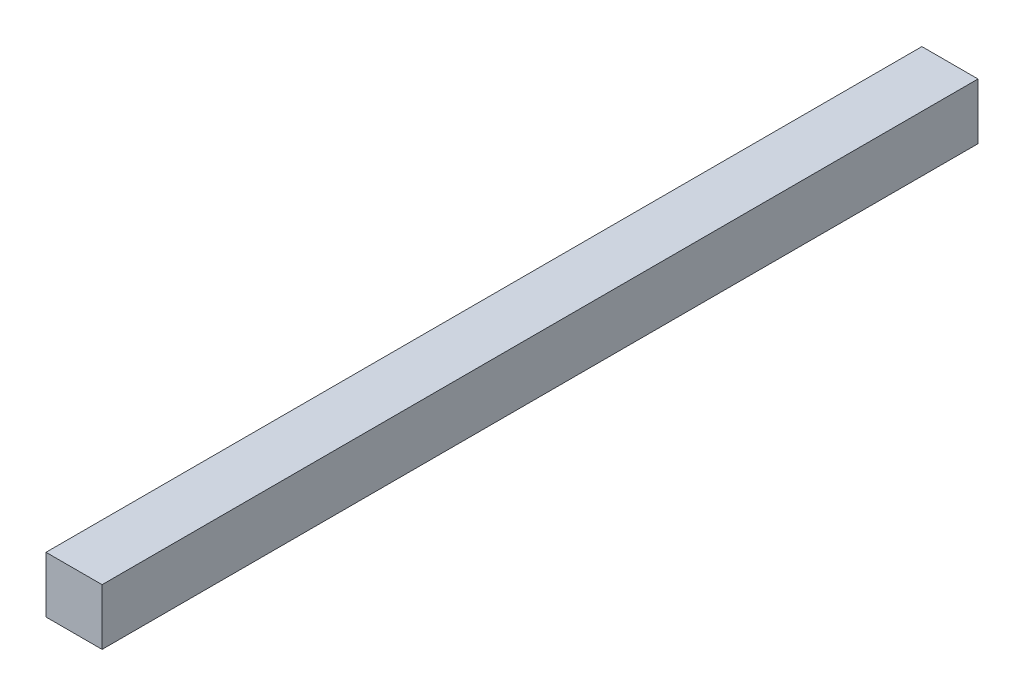
ISO-10303-21;
HEADER;
FILE_DESCRIPTION(('STEP AP214'),'2;1');
FILE_NAME('part.step','',(''),(''),'','','');
FILE_SCHEMA(('AUTOMOTIVE_DESIGN { 1 0 10303 214 1 1 1 1 }'));
ENDSEC;
DATA;
#1=APPLICATION_CONTEXT('core data for automotive mechanical design processes');
#2=APPLICATION_PROTOCOL_DEFINITION('international standard','automotive_design',2000,#1);
#3=PRODUCT_CONTEXT('',#1,'mechanical');
#4=PRODUCT('Part','Part','',(#3));
#5=PRODUCT_RELATED_PRODUCT_CATEGORY('part','',(#4));
#6=PRODUCT_DEFINITION_FORMATION('','',#4);
#7=PRODUCT_DEFINITION_CONTEXT('part definition',#1,'design');
#8=PRODUCT_DEFINITION('design','',#6,#7);
#9=PRODUCT_DEFINITION_SHAPE('','',#8);
#10=(LENGTH_UNIT() NAMED_UNIT(*) SI_UNIT(.MILLI.,.METRE.));
#11=(NAMED_UNIT(*) PLANE_ANGLE_UNIT() SI_UNIT($,.RADIAN.));
#12=(NAMED_UNIT(*) SI_UNIT($,.STERADIAN.) SOLID_ANGLE_UNIT());
#13=UNCERTAINTY_MEASURE_WITH_UNIT(LENGTH_MEASURE(1.E-05),#10,'distance_accuracy_value','');
#14=(GEOMETRIC_REPRESENTATION_CONTEXT(3) GLOBAL_UNCERTAINTY_ASSIGNED_CONTEXT((#13)) GLOBAL_UNIT_ASSIGNED_CONTEXT((#10,
#11,#12)) REPRESENTATION_CONTEXT('',''));
#15=CARTESIAN_POINT('',(0.,0.,0.));
#16=DIRECTION('',(0.,0.,1.));
#17=DIRECTION('',(1.,0.,0.));
#18=AXIS2_PLACEMENT_3D('',#15,#16,#17);
#19=CARTESIAN_POINT('',(-145.065848885291,10.0087439398412,-465.85441718585));
#20=DIRECTION('',(1.,0.,0.));
#21=DIRECTION('',(0.,0.,-1.));
#22=AXIS2_PLACEMENT_3D('',#19,#20,#21);
#23=PLANE('',#22);
#24=DIRECTION('',(0.,1.,0.));
#25=VECTOR('',#24,1.);
#26=CARTESIAN_POINT('',(-145.065848885291,10.0087439398412,4.14558281415001));
#27=LINE('',#26,#25);
#28=CARTESIAN_POINT('',(-145.065848885291,-20.0823309429157,4.14558281415001));
#29=VERTEX_POINT('',#28);
#30=CARTESIAN_POINT('',(-145.065848885291,10.0087439398412,4.14558281415001));
#31=VERTEX_POINT('',#30);
#32=EDGE_CURVE('E97',#29,#31,#27,.T.);
#33=ORIENTED_EDGE('',*,*,#32,.F.);
#34=DIRECTION('',(0.,0.,1.));
#35=VECTOR('',#34,1.);
#36=CARTESIAN_POINT('',(-145.065848885291,-20.0823309429157,-465.85441718585));
#37=LINE('',#36,#35);
#38=CARTESIAN_POINT('',(-145.065848885291,-20.0823309429157,-465.85441718585));
#39=VERTEX_POINT('',#38);
#40=EDGE_CURVE('E11',#39,#29,#37,.T.);
#41=ORIENTED_EDGE('',*,*,#40,.F.);
#42=DIRECTION('',(0.,1.,0.));
#43=VECTOR('',#42,1.);
#44=CARTESIAN_POINT('',(-145.065848885291,10.0087439398412,-465.85441718585));
#45=LINE('',#44,#43);
#46=CARTESIAN_POINT('',(-145.065848885291,10.0087439398412,-465.85441718585));
#47=VERTEX_POINT('',#46);
#48=EDGE_CURVE('E91',#39,#47,#45,.T.);
#49=ORIENTED_EDGE('',*,*,#48,.T.);
#50=DIRECTION('',(0.,0.,1.));
#51=VECTOR('',#50,1.);
#52=CARTESIAN_POINT('',(-145.065848885291,10.0087439398412,-465.85441718585));
#53=LINE('',#52,#51);
#54=EDGE_CURVE('E36',#47,#31,#53,.T.);
#55=ORIENTED_EDGE('',*,*,#54,.T.);
#56=EDGE_LOOP('',(#33,#41,#49,#55));
#57=FACE_BOUND('',#56,.T.);
#58=ADVANCED_FACE('F33',(#57),#23,.T.);
#59=CARTESIAN_POINT('',(-145.065848885291,-20.0823309429157,-465.85441718585));
#60=DIRECTION('',(0.,-1.,0.));
#61=DIRECTION('',(1.,0.,0.));
#62=AXIS2_PLACEMENT_3D('',#59,#60,#61);
#63=PLANE('',#62);
#64=DIRECTION('',(1.,0.,0.));
#65=VECTOR('',#64,1.);
#66=CARTESIAN_POINT('',(-145.065848885291,-20.0823309429157,4.14558281415001));
#67=LINE('',#66,#65);
#68=CARTESIAN_POINT('',(-175.168107780159,-20.0823309429157,4.14558281415001));
#69=VERTEX_POINT('',#68);
#70=EDGE_CURVE('E93',#69,#29,#67,.T.);
#71=ORIENTED_EDGE('',*,*,#70,.F.);
#72=DIRECTION('',(0.,0.,1.));
#73=VECTOR('',#72,1.);
#74=CARTESIAN_POINT('',(-175.168107780159,-20.0823309429157,-465.85441718585));
#75=LINE('',#74,#73);
#76=CARTESIAN_POINT('',(-175.168107780159,-20.0823309429157,-465.85441718585));
#77=VERTEX_POINT('',#76);
#78=EDGE_CURVE('E42',#77,#69,#75,.T.);
#79=ORIENTED_EDGE('',*,*,#78,.F.);
#80=DIRECTION('',(1.,0.,0.));
#81=VECTOR('',#80,1.);
#82=CARTESIAN_POINT('',(-145.065848885291,-20.0823309429157,-465.85441718585));
#83=LINE('',#82,#81);
#84=EDGE_CURVE('E88',#77,#39,#83,.T.);
#85=ORIENTED_EDGE('',*,*,#84,.T.);
#86=ORIENTED_EDGE('',*,*,#40,.T.);
#87=EDGE_LOOP('',(#71,#79,#85,#86));
#88=FACE_BOUND('',#87,.T.);
#89=ADVANCED_FACE('F107',(#88),#63,.T.);
#90=CARTESIAN_POINT('',(-175.168107780159,10.0087439398412,-465.85441718585));
#91=DIRECTION('',(-1.,0.,0.));
#92=DIRECTION('',(0.,0.,1.));
#93=AXIS2_PLACEMENT_3D('',#90,#91,#92);
#94=PLANE('',#93);
#95=DIRECTION('',(0.,-1.,0.));
#96=VECTOR('',#95,1.);
#97=CARTESIAN_POINT('',(-175.168107780159,10.0087439398412,4.14558281415001));
#98=LINE('',#97,#96);
#99=CARTESIAN_POINT('',(-175.168107780159,10.0087439398412,4.14558281415001));
#100=VERTEX_POINT('',#99);
#101=EDGE_CURVE('E83',#100,#69,#98,.T.);
#102=ORIENTED_EDGE('',*,*,#101,.F.);
#103=DIRECTION('',(0.,0.,1.));
#104=VECTOR('',#103,1.);
#105=CARTESIAN_POINT('',(-175.168107780159,10.0087439398412,-465.85441718585));
#106=LINE('',#105,#104);
#107=CARTESIAN_POINT('',(-175.168107780159,10.0087439398412,-465.85441718585));
#108=VERTEX_POINT('',#107);
#109=EDGE_CURVE('E78',#108,#100,#106,.T.);
#110=ORIENTED_EDGE('',*,*,#109,.F.);
#111=DIRECTION('',(0.,-1.,0.));
#112=VECTOR('',#111,1.);
#113=CARTESIAN_POINT('',(-175.168107780159,10.0087439398412,-465.85441718585));
#114=LINE('',#113,#112);
#115=EDGE_CURVE('E81',#108,#77,#114,.T.);
#116=ORIENTED_EDGE('',*,*,#115,.T.);
#117=ORIENTED_EDGE('',*,*,#78,.T.);
#118=EDGE_LOOP('',(#102,#110,#116,#117));
#119=FACE_BOUND('',#118,.T.);
#120=ADVANCED_FACE('F80',(#119),#94,.T.);
#121=CARTESIAN_POINT('',(-145.065848885291,10.0087439398412,-465.85441718585));
#122=DIRECTION('',(0.,1.,0.));
#123=DIRECTION('',(-1.,0.,0.));
#124=AXIS2_PLACEMENT_3D('',#121,#122,#123);
#125=PLANE('',#124);
#126=DIRECTION('',(-1.,0.,0.));
#127=VECTOR('',#126,1.);
#128=CARTESIAN_POINT('',(-145.065848885291,10.0087439398412,4.14558281415001));
#129=LINE('',#128,#127);
#130=EDGE_CURVE('E100',#31,#100,#129,.T.);
#131=ORIENTED_EDGE('',*,*,#130,.F.);
#132=ORIENTED_EDGE('',*,*,#54,.F.);
#133=DIRECTION('',(-1.,0.,0.));
#134=VECTOR('',#133,1.);
#135=CARTESIAN_POINT('',(-145.065848885291,10.0087439398412,-465.85441718585));
#136=LINE('',#135,#134);
#137=EDGE_CURVE('E87',#47,#108,#136,.T.);
#138=ORIENTED_EDGE('',*,*,#137,.T.);
#139=ORIENTED_EDGE('',*,*,#109,.T.);
#140=EDGE_LOOP('',(#131,#132,#138,#139));
#141=FACE_BOUND('',#140,.T.);
#142=ADVANCED_FACE('F90',(#141),#125,.T.);
#143=CARTESIAN_POINT('',(0.,0.,-465.85441718585));
#144=DIRECTION('',(0.,0.,-1.));
#145=DIRECTION('',(-1.,0.,0.));
#146=AXIS2_PLACEMENT_3D('',#143,#144,#145);
#147=PLANE('',#146);
#148=ORIENTED_EDGE('',*,*,#48,.F.);
#149=ORIENTED_EDGE('',*,*,#84,.F.);
#150=ORIENTED_EDGE('',*,*,#115,.F.);
#151=ORIENTED_EDGE('',*,*,#137,.F.);
#152=EDGE_LOOP('',(#148,#149,#150,#151));
#153=FACE_BOUND('',#152,.T.);
#154=ADVANCED_FACE('F86',(#153),#147,.T.);
#155=CARTESIAN_POINT('',(0.,0.,4.14558281415001));
#156=DIRECTION('',(0.,0.,-1.));
#157=DIRECTION('',(-1.,0.,0.));
#158=AXIS2_PLACEMENT_3D('',#155,#156,#157);
#159=PLANE('',#158);
#160=ORIENTED_EDGE('',*,*,#32,.T.);
#161=ORIENTED_EDGE('',*,*,#130,.T.);
#162=ORIENTED_EDGE('',*,*,#101,.T.);
#163=ORIENTED_EDGE('',*,*,#70,.T.);
#164=EDGE_LOOP('',(#160,#161,#162,#163));
#165=FACE_BOUND('',#164,.T.);
#166=ADVANCED_FACE('F106',(#165),#159,.F.);
#167=CLOSED_SHELL('',(#58,#89,#120,#142,#154,#166));
#168=MANIFOLD_SOLID_BREP('B2',#167);
#169=ADVANCED_BREP_SHAPE_REPRESENTATION('',(#18,#168),#14);
#170=SHAPE_DEFINITION_REPRESENTATION(#9,#169);
ENDSEC;
END-ISO-10303-21;
